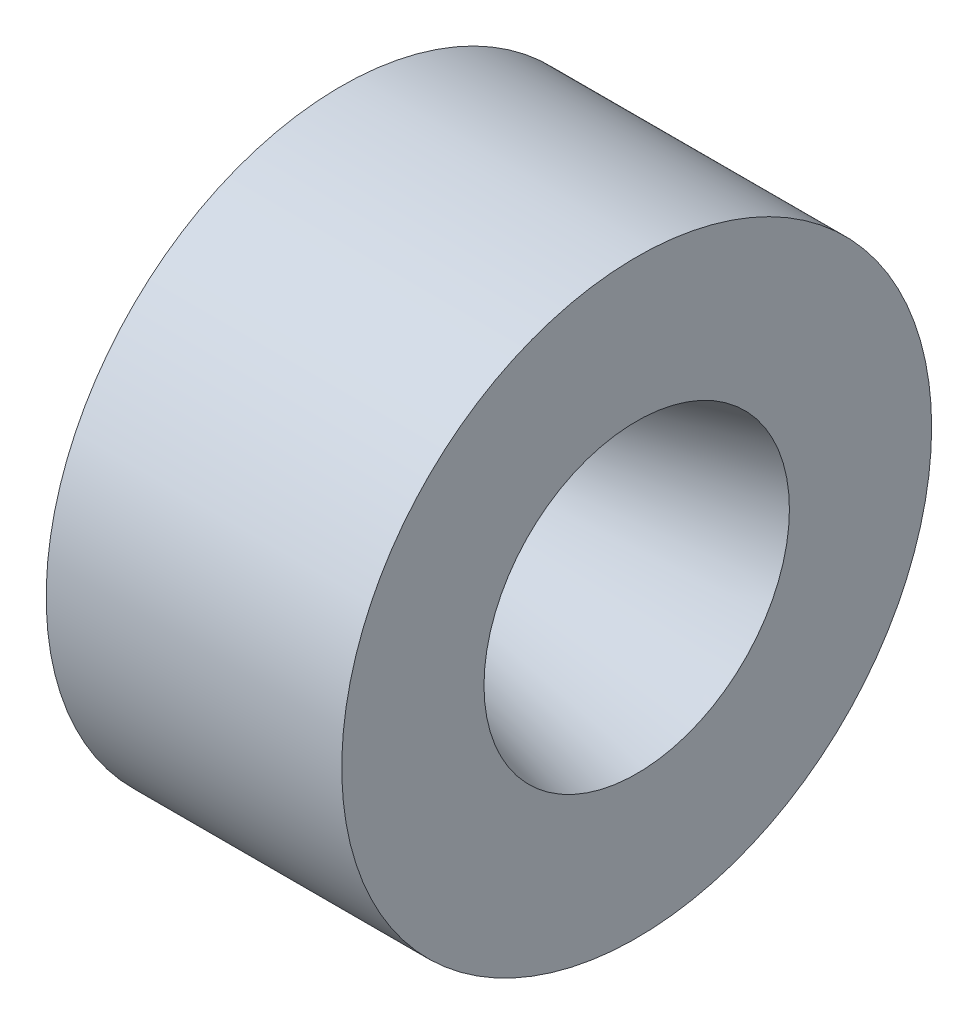
ISO-10303-21;
HEADER;
FILE_DESCRIPTION(('STEP AP214'),'2;1');
FILE_NAME('part.step','',(''),(''),'','','');
FILE_SCHEMA(('AUTOMOTIVE_DESIGN { 1 0 10303 214 1 1 1 1 }'));
ENDSEC;
DATA;
#1=APPLICATION_CONTEXT('core data for automotive mechanical design processes');
#2=APPLICATION_PROTOCOL_DEFINITION('international standard','automotive_design',2000,#1);
#3=PRODUCT_CONTEXT('',#1,'mechanical');
#4=PRODUCT('Part','Part','',(#3));
#5=PRODUCT_RELATED_PRODUCT_CATEGORY('part','',(#4));
#6=PRODUCT_DEFINITION_FORMATION('','',#4);
#7=PRODUCT_DEFINITION_CONTEXT('part definition',#1,'design');
#8=PRODUCT_DEFINITION('design','',#6,#7);
#9=PRODUCT_DEFINITION_SHAPE('','',#8);
#10=(LENGTH_UNIT() NAMED_UNIT(*) SI_UNIT(.MILLI.,.METRE.));
#11=(NAMED_UNIT(*) PLANE_ANGLE_UNIT() SI_UNIT($,.RADIAN.));
#12=(NAMED_UNIT(*) SI_UNIT($,.STERADIAN.) SOLID_ANGLE_UNIT());
#13=UNCERTAINTY_MEASURE_WITH_UNIT(LENGTH_MEASURE(1.E-05),#10,'distance_accuracy_value','');
#14=(GEOMETRIC_REPRESENTATION_CONTEXT(3) GLOBAL_UNCERTAINTY_ASSIGNED_CONTEXT((#13)) GLOBAL_UNIT_ASSIGNED_CONTEXT((#10,
#11,#12)) REPRESENTATION_CONTEXT('',''));
#15=CARTESIAN_POINT('',(0.,0.,0.));
#16=DIRECTION('',(0.,0.,1.));
#17=DIRECTION('',(1.,0.,0.));
#18=AXIS2_PLACEMENT_3D('',#15,#16,#17);
#19=CARTESIAN_POINT('',(152.7302,0.,0.));
#20=DIRECTION('',(1.,0.,0.));
#21=DIRECTION('',(0.,0.,-1.));
#22=AXIS2_PLACEMENT_3D('',#19,#20,#21);
#23=CYLINDRICAL_SURFACE('',#22,50.038);
#24=CARTESIAN_POINT('',(154.3304,0.,0.));
#25=DIRECTION('',(1.,0.,0.));
#26=DIRECTION('',(0.,0.,-1.));
#27=AXIS2_PLACEMENT_3D('',#24,#25,#26);
#28=CIRCLE('',#27,50.038);
#29=CARTESIAN_POINT('',(154.3304,0.,-50.038));
#30=VERTEX_POINT('',#29);
#31=EDGE_CURVE('E61',#30,#30,#28,.T.);
#32=ORIENTED_EDGE('',*,*,#31,.T.);
#33=EDGE_LOOP('',(#32));
#34=FACE_BOUND('',#33,.T.);
#35=CARTESIAN_POINT('',(204.475298590178,0.,0.));
#36=DIRECTION('',(1.,0.,0.));
#37=DIRECTION('',(0.,0.,-1.));
#38=AXIS2_PLACEMENT_3D('',#35,#36,#37);
#39=CIRCLE('',#38,50.038);
#40=CARTESIAN_POINT('',(204.475298590178,0.,-50.038));
#41=VERTEX_POINT('',#40);
#42=EDGE_CURVE('E73',#41,#41,#39,.T.);
#43=ORIENTED_EDGE('',*,*,#42,.F.);
#44=EDGE_LOOP('',(#43));
#45=FACE_BOUND('',#44,.T.);
#46=ADVANCED_FACE('F35',(#34,#45),#23,.T.);
#47=CARTESIAN_POINT('',(154.3304,50.038,0.));
#48=DIRECTION('',(-1.,0.,0.));
#49=DIRECTION('',(0.,0.,1.));
#50=AXIS2_PLACEMENT_3D('',#47,#48,#49);
#51=PLANE('',#50);
#52=CARTESIAN_POINT('',(154.3304,0.,0.));
#53=DIRECTION('',(-1.,0.,0.));
#54=DIRECTION('',(0.,0.,1.));
#55=AXIS2_PLACEMENT_3D('',#52,#53,#54);
#56=CIRCLE('',#55,44.069);
#57=CARTESIAN_POINT('',(154.3304,0.,44.069));
#58=VERTEX_POINT('',#57);
#59=EDGE_CURVE('E58',#58,#58,#56,.F.);
#60=ORIENTED_EDGE('',*,*,#59,.T.);
#61=EDGE_LOOP('',(#60));
#62=FACE_BOUND('',#61,.T.);
#63=ORIENTED_EDGE('',*,*,#31,.F.);
#64=EDGE_LOOP('',(#63));
#65=FACE_BOUND('',#64,.T.);
#66=ADVANCED_FACE('F81',(#62,#65),#51,.T.);
#67=CARTESIAN_POINT('',(152.7302,0.,0.));
#68=DIRECTION('',(1.,0.,0.));
#69=DIRECTION('',(0.,0.,-1.));
#70=AXIS2_PLACEMENT_3D('',#67,#68,#69);
#71=CYLINDRICAL_SURFACE('',#70,43.815);
#72=CARTESIAN_POINT('',(154.0764,0.,0.));
#73=DIRECTION('',(-1.,0.,0.));
#74=DIRECTION('',(0.,0.,1.));
#75=AXIS2_PLACEMENT_3D('',#72,#73,#74);
#76=CIRCLE('',#75,43.815);
#77=CARTESIAN_POINT('',(154.0764,0.,43.815));
#78=VERTEX_POINT('',#77);
#79=EDGE_CURVE('E55',#78,#78,#76,.T.);
#80=ORIENTED_EDGE('',*,*,#79,.T.);
#81=EDGE_LOOP('',(#80));
#82=FACE_BOUND('',#81,.T.);
#83=CARTESIAN_POINT('',(151.7904,0.,0.));
#84=DIRECTION('',(1.,0.,0.));
#85=DIRECTION('',(0.,0.,-1.));
#86=AXIS2_PLACEMENT_3D('',#83,#84,#85);
#87=CIRCLE('',#86,43.815);
#88=CARTESIAN_POINT('',(151.7904,0.,-43.815));
#89=VERTEX_POINT('',#88);
#90=EDGE_CURVE('E64',#89,#89,#87,.T.);
#91=ORIENTED_EDGE('',*,*,#90,.T.);
#92=EDGE_LOOP('',(#91));
#93=FACE_BOUND('',#92,.T.);
#94=ADVANCED_FACE('F87',(#82,#93),#71,.T.);
#95=CARTESIAN_POINT('',(151.7904,43.815,0.));
#96=DIRECTION('',(-1.,0.,0.));
#97=DIRECTION('',(0.,0.,1.));
#98=AXIS2_PLACEMENT_3D('',#95,#96,#97);
#99=PLANE('',#98);
#100=CARTESIAN_POINT('',(151.7904,0.,0.));
#101=DIRECTION('',(1.,0.,0.));
#102=DIRECTION('',(0.,0.,-1.));
#103=AXIS2_PLACEMENT_3D('',#100,#101,#102);
#104=CIRCLE('',#103,40.767);
#105=CARTESIAN_POINT('',(151.7904,0.,-40.767));
#106=VERTEX_POINT('',#105);
#107=EDGE_CURVE('E67',#106,#106,#104,.T.);
#108=ORIENTED_EDGE('',*,*,#107,.T.);
#109=EDGE_LOOP('',(#108));
#110=FACE_BOUND('',#109,.T.);
#111=ORIENTED_EDGE('',*,*,#90,.F.);
#112=EDGE_LOOP('',(#111));
#113=FACE_BOUND('',#112,.T.);
#114=ADVANCED_FACE('F117',(#110,#113),#99,.T.);
#115=CARTESIAN_POINT('',(152.7302,0.,0.));
#116=DIRECTION('',(1.,0.,0.));
#117=DIRECTION('',(0.,0.,-1.));
#118=AXIS2_PLACEMENT_3D('',#115,#116,#117);
#119=CYLINDRICAL_SURFACE('',#118,40.767);
#120=CARTESIAN_POINT('',(153.008159691599,0.,0.));
#121=DIRECTION('',(1.,0.,0.));
#122=DIRECTION('',(0.,0.,-1.));
#123=AXIS2_PLACEMENT_3D('',#120,#121,#122);
#124=CIRCLE('',#123,40.767);
#125=CARTESIAN_POINT('',(153.008159691599,0.,-40.767));
#126=VERTEX_POINT('',#125);
#127=EDGE_CURVE('E42',#126,#126,#124,.T.);
#128=ORIENTED_EDGE('',*,*,#127,.T.);
#129=EDGE_LOOP('',(#128));
#130=FACE_BOUND('',#129,.T.);
#131=ORIENTED_EDGE('',*,*,#107,.F.);
#132=EDGE_LOOP('',(#131));
#133=FACE_BOUND('',#132,.T.);
#134=ADVANCED_FACE('F109',(#130,#133),#119,.F.);
#135=CARTESIAN_POINT('',(154.3304,0.,0.));
#136=DIRECTION('',(-1.,0.,0.));
#137=DIRECTION('',(0.,0.,1.));
#138=AXIS2_PLACEMENT_3D('',#135,#136,#137);
#139=CONICAL_SURFACE('',#138,40.767,0.959931088596883);
#140=CARTESIAN_POINT('',(155.088805884093,0.,0.));
#141=DIRECTION('',(-1.,0.,0.));
#142=DIRECTION('',(0.,0.,1.));
#143=AXIS2_PLACEMENT_3D('',#140,#141,#142);
#144=CIRCLE('',#143,39.6838841483317);
#145=CARTESIAN_POINT('',(155.088805884093,0.,39.6838841483317));
#146=VERTEX_POINT('',#145);
#147=EDGE_CURVE('E10',#146,#146,#144,.T.);
#148=ORIENTED_EDGE('',*,*,#147,.T.);
#149=EDGE_LOOP('',(#148));
#150=FACE_BOUND('',#149,.T.);
#151=CARTESIAN_POINT('',(170.502924007874,0.,0.));
#152=DIRECTION('',(1.,0.,0.));
#153=DIRECTION('',(0.,0.,-1.));
#154=AXIS2_PLACEMENT_3D('',#151,#152,#153);
#155=CIRCLE('',#154,17.6702420741658);
#156=CARTESIAN_POINT('',(170.502924007874,0.,-17.6702420741658));
#157=VERTEX_POINT('',#156);
#158=EDGE_CURVE('E50',#157,#157,#155,.T.);
#159=ORIENTED_EDGE('',*,*,#158,.T.);
#160=EDGE_LOOP('',(#159));
#161=FACE_BOUND('',#160,.T.);
#162=ADVANCED_FACE('F106',(#150,#161),#139,.F.);
#163=CARTESIAN_POINT('',(171.012984639354,0.,0.));
#164=DIRECTION('',(1.,0.,0.));
#165=DIRECTION('',(0.,0.,-1.));
#166=AXIS2_PLACEMENT_3D('',#163,#164,#165);
#167=CONICAL_SURFACE('',#166,16.9418,0.26179938779915);
#168=CARTESIAN_POINT('',(171.871947291401,0.,0.));
#169=DIRECTION('',(-1.,0.,0.));
#170=DIRECTION('',(0.,0.,1.));
#171=AXIS2_PLACEMENT_3D('',#168,#169,#170);
#172=CIRCLE('',#171,17.1719583489445);
#173=CARTESIAN_POINT('',(171.871947291401,0.,17.1719583489445));
#174=VERTEX_POINT('',#173);
#175=EDGE_CURVE('E46',#174,#174,#172,.T.);
#176=ORIENTED_EDGE('',*,*,#175,.T.);
#177=EDGE_LOOP('',(#176));
#178=FACE_BOUND('',#177,.T.);
#179=CARTESIAN_POINT('',(204.475298590178,0.,0.));
#180=DIRECTION('',(1.,0.,0.));
#181=DIRECTION('',(0.,0.,-1.));
#182=AXIS2_PLACEMENT_3D('',#179,#180,#181);
#183=CIRCLE('',#182,25.908);
#184=CARTESIAN_POINT('',(204.475298590178,0.,-25.908));
#185=VERTEX_POINT('',#184);
#186=EDGE_CURVE('E70',#185,#185,#183,.T.);
#187=ORIENTED_EDGE('',*,*,#186,.T.);
#188=EDGE_LOOP('',(#187));
#189=FACE_BOUND('',#188,.T.);
#190=ADVANCED_FACE('F108',(#178,#189),#167,.F.);
#191=CARTESIAN_POINT('',(204.475298590178,25.908,0.));
#192=DIRECTION('',(1.,0.,0.));
#193=DIRECTION('',(0.,0.,-1.));
#194=AXIS2_PLACEMENT_3D('',#191,#192,#193);
#195=PLANE('',#194);
#196=ORIENTED_EDGE('',*,*,#42,.T.);
#197=EDGE_LOOP('',(#196));
#198=FACE_BOUND('',#197,.T.);
#199=ORIENTED_EDGE('',*,*,#186,.F.);
#200=EDGE_LOOP('',(#199));
#201=FACE_BOUND('',#200,.T.);
#202=ADVANCED_FACE('F77',(#198,#201),#195,.T.);
#203=CARTESIAN_POINT('',(154.0764,0.,0.));
#204=DIRECTION('',(-1.,0.,0.));
#205=DIRECTION('',(0.,0.,1.));
#206=AXIS2_PLACEMENT_3D('',#203,#204,#205);
#207=TOROIDAL_SURFACE('',#206,44.069,0.254);
#208=ORIENTED_EDGE('',*,*,#79,.F.);
#209=EDGE_LOOP('',(#208));
#210=FACE_BOUND('',#209,.T.);
#211=ORIENTED_EDGE('',*,*,#59,.F.);
#212=EDGE_LOOP('',(#211));
#213=FACE_BOUND('',#212,.T.);
#214=ADVANCED_FACE('F92',(#210,#213),#207,.F.);
#215=CARTESIAN_POINT('',(171.543247104121,0.,0.));
#216=DIRECTION('',(-1.,0.,0.));
#217=DIRECTION('',(0.,0.,1.));
#218=AXIS2_PLACEMENT_3D('',#215,#216,#217);
#219=TOROIDAL_SURFACE('',#218,18.3986841483317,1.27);
#220=ORIENTED_EDGE('',*,*,#175,.F.);
#221=EDGE_LOOP('',(#220));
#222=FACE_BOUND('',#221,.T.);
#223=ORIENTED_EDGE('',*,*,#158,.F.);
#224=EDGE_LOOP('',(#223));
#225=FACE_BOUND('',#224,.T.);
#226=ADVANCED_FACE('F94',(#222,#225),#219,.T.);
#227=CARTESIAN_POINT('',(153.008159691599,0.,0.));
#228=DIRECTION('',(1.,0.,0.));
#229=DIRECTION('',(0.,0.,-1.));
#230=AXIS2_PLACEMENT_3D('',#227,#228,#229);
#231=TOROIDAL_SURFACE('',#230,38.227,2.54);
#232=ORIENTED_EDGE('',*,*,#147,.F.);
#233=EDGE_LOOP('',(#232));
#234=FACE_BOUND('',#233,.T.);
#235=ORIENTED_EDGE('',*,*,#127,.F.);
#236=EDGE_LOOP('',(#235));
#237=FACE_BOUND('',#236,.T.);
#238=ADVANCED_FACE('F37',(#234,#237),#231,.F.);
#239=CLOSED_SHELL('',(#46,#66,#94,#114,#134,#162,#190,#202,#214,#226,#238));
#240=MANIFOLD_SOLID_BREP('B2',#239);
#241=ADVANCED_BREP_SHAPE_REPRESENTATION('',(#18,#240),#14);
#242=SHAPE_DEFINITION_REPRESENTATION(#9,#241);
ENDSEC;
END-ISO-10303-21;
